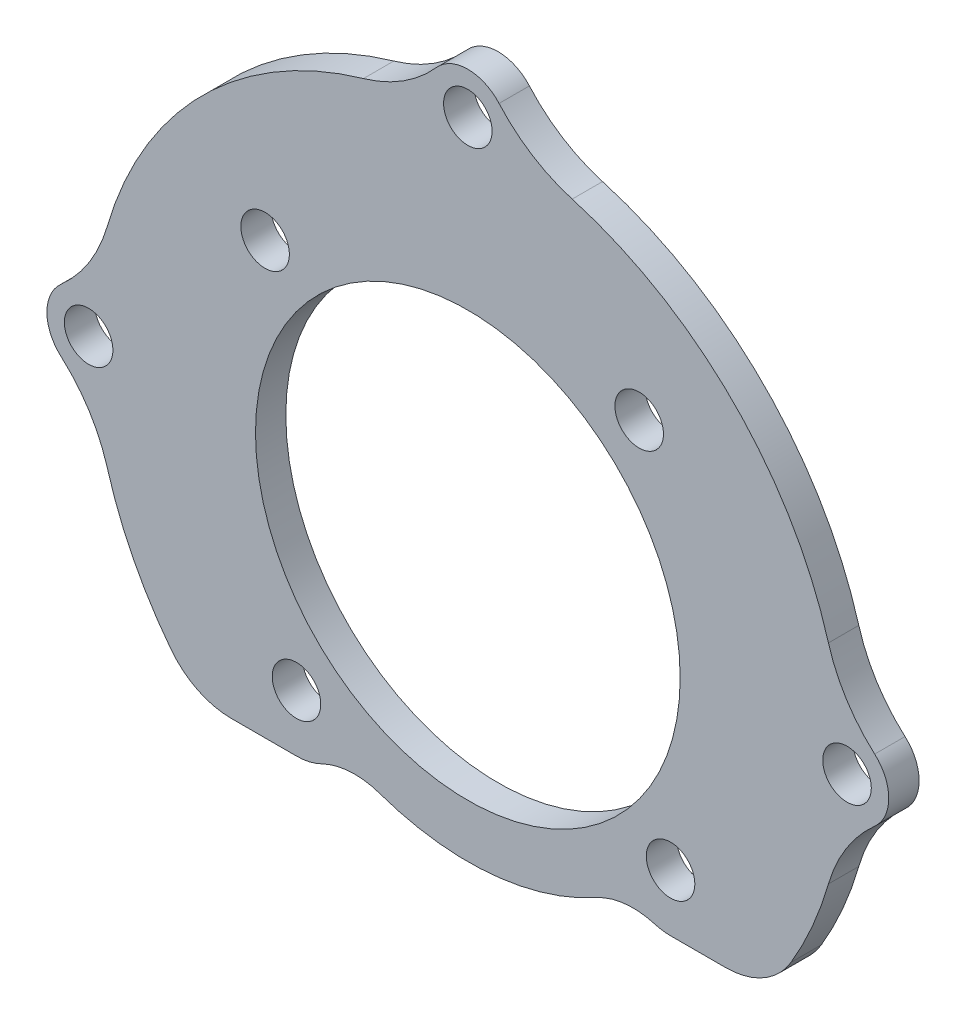
ISO-10303-21;
HEADER;
FILE_DESCRIPTION(('STEP AP214'),'2;1');
FILE_NAME('part.step','',(''),(''),'','','');
FILE_SCHEMA(('AUTOMOTIVE_DESIGN { 1 0 10303 214 1 1 1 1 }'));
ENDSEC;
DATA;
#1=APPLICATION_CONTEXT('core data for automotive mechanical design processes');
#2=APPLICATION_PROTOCOL_DEFINITION('international standard','automotive_design',2000,#1);
#3=PRODUCT_CONTEXT('',#1,'mechanical');
#4=PRODUCT('Part','Part','',(#3));
#5=PRODUCT_RELATED_PRODUCT_CATEGORY('part','',(#4));
#6=PRODUCT_DEFINITION_FORMATION('','',#4);
#7=PRODUCT_DEFINITION_CONTEXT('part definition',#1,'design');
#8=PRODUCT_DEFINITION('design','',#6,#7);
#9=PRODUCT_DEFINITION_SHAPE('','',#8);
#10=(LENGTH_UNIT() NAMED_UNIT(*) SI_UNIT(.MILLI.,.METRE.));
#11=(NAMED_UNIT(*) PLANE_ANGLE_UNIT() SI_UNIT($,.RADIAN.));
#12=(NAMED_UNIT(*) SI_UNIT($,.STERADIAN.) SOLID_ANGLE_UNIT());
#13=UNCERTAINTY_MEASURE_WITH_UNIT(LENGTH_MEASURE(1.E-05),#10,'distance_accuracy_value','');
#14=(GEOMETRIC_REPRESENTATION_CONTEXT(3) GLOBAL_UNCERTAINTY_ASSIGNED_CONTEXT((#13)) GLOBAL_UNIT_ASSIGNED_CONTEXT((#10,
#11,#12)) REPRESENTATION_CONTEXT('',''));
#15=CARTESIAN_POINT('',(0.,0.,0.));
#16=DIRECTION('',(0.,0.,1.));
#17=DIRECTION('',(1.,0.,0.));
#18=AXIS2_PLACEMENT_3D('',#15,#16,#17);
#19=CARTESIAN_POINT('',(0.,0.,2.));
#20=DIRECTION('',(0.,0.,1.));
#21=DIRECTION('',(1.,0.,0.));
#22=AXIS2_PLACEMENT_3D('',#19,#20,#21);
#23=PLANE('',#22);
#24=CARTESIAN_POINT('',(-36.2962532754929,-53.4658019563387,2.));
#25=DIRECTION('',(0.,0.,1.));
#26=DIRECTION('',(1.,0.,0.));
#27=AXIS2_PLACEMENT_3D('',#24,#25,#26);
#28=CIRCLE('',#27,1.6);
#29=CARTESIAN_POINT('',(-34.6962532754929,-53.4658019563387,2.));
#30=VERTEX_POINT('',#29);
#31=EDGE_CURVE('E320',#30,#30,#28,.T.);
#32=ORIENTED_EDGE('',*,*,#31,.F.);
#33=EDGE_LOOP('',(#32));
#34=FACE_BOUND('',#33,.T.);
#35=CARTESIAN_POINT('',(-11.6341980436611,-51.3962532754927,2.));
#36=DIRECTION('',(0.,0.,1.));
#37=DIRECTION('',(1.,0.,0.));
#38=AXIS2_PLACEMENT_3D('',#35,#36,#37);
#39=CIRCLE('',#38,1.6);
#40=CARTESIAN_POINT('',(-10.0341980436611,-51.3962532754927,2.));
#41=VERTEX_POINT('',#40);
#42=EDGE_CURVE('E308',#41,#41,#39,.T.);
#43=ORIENTED_EDGE('',*,*,#42,.F.);
#44=EDGE_LOOP('',(#43));
#45=FACE_BOUND('',#44,.T.);
#46=CARTESIAN_POINT('',(-25.,-40.0999999999998,2.));
#47=DIRECTION('',(0.,0.,1.));
#48=DIRECTION('',(1.,0.,0.));
#49=AXIS2_PLACEMENT_3D('',#46,#47,#48);
#50=CIRCLE('',#49,14.);
#51=CARTESIAN_POINT('',(-11.,-40.0999999999998,2.));
#52=VERTEX_POINT('',#51);
#53=EDGE_CURVE('E290',#52,#52,#50,.T.);
#54=ORIENTED_EDGE('',*,*,#53,.F.);
#55=EDGE_LOOP('',(#54));
#56=FACE_BOUND('',#55,.T.);
#57=CARTESIAN_POINT('',(-13.7037467245071,-26.7341980436609,2.));
#58=DIRECTION('',(0.,0.,1.));
#59=DIRECTION('',(1.,0.,0.));
#60=AXIS2_PLACEMENT_3D('',#57,#58,#59);
#61=CIRCLE('',#60,1.6);
#62=CARTESIAN_POINT('',(-12.1037467245071,-26.7341980436609,2.));
#63=VERTEX_POINT('',#62);
#64=EDGE_CURVE('E314',#63,#63,#61,.T.);
#65=ORIENTED_EDGE('',*,*,#64,.F.);
#66=EDGE_LOOP('',(#65));
#67=FACE_BOUND('',#66,.T.);
#68=CARTESIAN_POINT('',(-38.3658019563389,-28.8037467245069,2.));
#69=DIRECTION('',(0.,0.,1.));
#70=DIRECTION('',(1.,0.,0.));
#71=AXIS2_PLACEMENT_3D('',#68,#69,#70);
#72=CIRCLE('',#71,1.6);
#73=CARTESIAN_POINT('',(-36.7658019563389,-28.8037467245069,2.));
#74=VERTEX_POINT('',#73);
#75=EDGE_CURVE('E321',#74,#74,#72,.T.);
#76=ORIENTED_EDGE('',*,*,#75,.F.);
#77=EDGE_LOOP('',(#76));
#78=FACE_BOUND('',#77,.T.);
#79=CARTESIAN_POINT('',(0.,-40.0999999999998,2.));
#80=DIRECTION('',(0.,0.,1.));
#81=DIRECTION('',(1.,0.,0.));
#82=AXIS2_PLACEMENT_3D('',#79,#80,#81);
#83=CIRCLE('',#82,1.6);
#84=CARTESIAN_POINT('',(1.6,-40.0999999999998,2.));
#85=VERTEX_POINT('',#84);
#86=EDGE_CURVE('E263',#85,#85,#83,.T.);
#87=ORIENTED_EDGE('',*,*,#86,.F.);
#88=EDGE_LOOP('',(#87));
#89=FACE_BOUND('',#88,.T.);
#90=CARTESIAN_POINT('',(-25.,-15.0999999999998,2.));
#91=DIRECTION('',(0.,0.,1.));
#92=DIRECTION('',(1.,0.,0.));
#93=AXIS2_PLACEMENT_3D('',#90,#91,#92);
#94=CIRCLE('',#93,1.6);
#95=CARTESIAN_POINT('',(-23.4,-15.0999999999998,2.));
#96=VERTEX_POINT('',#95);
#97=EDGE_CURVE('E297',#96,#96,#94,.T.);
#98=ORIENTED_EDGE('',*,*,#97,.F.);
#99=EDGE_LOOP('',(#98));
#100=FACE_BOUND('',#99,.T.);
#101=CARTESIAN_POINT('',(-50.,-40.0999999999998,2.));
#102=DIRECTION('',(0.,0.,1.));
#103=DIRECTION('',(1.,0.,0.));
#104=AXIS2_PLACEMENT_3D('',#101,#102,#103);
#105=CIRCLE('',#104,1.6);
#106=CARTESIAN_POINT('',(-48.4,-40.0999999999998,2.));
#107=VERTEX_POINT('',#106);
#108=EDGE_CURVE('E291',#107,#107,#105,.T.);
#109=ORIENTED_EDGE('',*,*,#108,.F.);
#110=EDGE_LOOP('',(#109));
#111=FACE_BOUND('',#110,.T.);
#112=CARTESIAN_POINT('',(-25.,-40.0999999999998,2.));
#113=DIRECTION('',(0.,0.,1.));
#114=DIRECTION('',(1.,0.,0.));
#115=AXIS2_PLACEMENT_3D('',#112,#113,#114);
#116=CIRCLE('',#115,24.75);
#117=CARTESIAN_POINT('',(-48.7741428571428,-46.9813248294322,2.));
#118=VERTEX_POINT('',#117);
#119=CARTESIAN_POINT('',(-44.5457455475951,-55.2830935908548,2.));
#120=VERTEX_POINT('',#119);
#121=EDGE_CURVE('E240',#118,#120,#116,.T.);
#122=ORIENTED_EDGE('',*,*,#121,.T.);
#123=CARTESIAN_POINT('',(-40.5971100834345,-52.2158019563387,2.));
#124=DIRECTION('',(0.,0.,1.));
#125=DIRECTION('',(0.,-1.,0.));
#126=AXIS2_PLACEMENT_3D('',#123,#124,#125);
#127=CIRCLE('',#126,5.);
#128=CARTESIAN_POINT('',(-40.5971100834345,-57.2158019563387,2.));
#129=VERTEX_POINT('',#128);
#130=EDGE_CURVE('E212',#120,#129,#127,.T.);
#131=ORIENTED_EDGE('',*,*,#130,.T.);
#132=DIRECTION('',(-1.,0.,0.));
#133=VECTOR('',#132,1.);
#134=CARTESIAN_POINT('',(0.,-57.2158019563387,2.));
#135=LINE('',#134,#133);
#136=CARTESIAN_POINT('',(-36.2962532754929,-57.2158019563387,2.));
#137=VERTEX_POINT('',#136);
#138=EDGE_CURVE('E193',#137,#129,#135,.T.);
#139=ORIENTED_EDGE('',*,*,#138,.F.);
#140=CARTESIAN_POINT('',(-36.2962532754929,-53.4658019563387,2.));
#141=DIRECTION('',(0.,0.,1.));
#142=DIRECTION('',(1.,0.,0.));
#143=AXIS2_PLACEMENT_3D('',#140,#141,#142);
#144=CIRCLE('',#143,3.75);
#145=CARTESIAN_POINT('',(-34.6507662159953,-56.8355011027056,2.));
#146=VERTEX_POINT('',#145);
#147=EDGE_CURVE('E204',#137,#146,#144,.T.);
#148=ORIENTED_EDGE('',*,*,#147,.T.);
#149=CARTESIAN_POINT('',(-32.4567834699984,-61.3284332978614,2.));
#150=DIRECTION('',(0.,0.,1.));
#151=DIRECTION('',(0.,-1.,0.));
#152=AXIS2_PLACEMENT_3D('',#149,#150,#151);
#153=CIRCLE('',#152,5.);
#154=CARTESIAN_POINT('',(-30.7997204766657,-56.6110036761153,2.));
#155=VERTEX_POINT('',#154);
#156=EDGE_CURVE('E47',#146,#155,#153,.F.);
#157=ORIENTED_EDGE('',*,*,#156,.T.);
#158=CARTESIAN_POINT('',(-25.,-40.0999999999998,2.));
#159=DIRECTION('',(0.,0.,1.));
#160=DIRECTION('',(1.,0.,0.));
#161=AXIS2_PLACEMENT_3D('',#158,#159,#160);
#162=CIRCLE('',#161,17.5000000000045);
#163=CARTESIAN_POINT('',(-16.5296833529576,-55.4135148120536,2.));
#164=VERTEX_POINT('',#163);
#165=EDGE_CURVE('E208',#155,#164,#162,.T.);
#166=ORIENTED_EDGE('',*,*,#165,.T.);
#167=CARTESIAN_POINT('',(-14.1095928823746,-59.7888047583536,2.));
#168=DIRECTION('',(0.,0.,1.));
#169=DIRECTION('',(0.,-1.,0.));
#170=AXIS2_PLACEMENT_3D('',#167,#168,#169);
#171=CIRCLE('',#170,5.);
#172=CARTESIAN_POINT('',(-12.6950815459669,-54.9930610538617,2.));
#173=VERTEX_POINT('',#172);
#174=EDGE_CURVE('E54',#164,#173,#171,.F.);
#175=ORIENTED_EDGE('',*,*,#174,.T.);
#176=CARTESIAN_POINT('',(-11.6341980436611,-51.3962532754927,2.));
#177=DIRECTION('',(0.,0.,1.));
#178=DIRECTION('',(1.,0.,0.));
#179=AXIS2_PLACEMENT_3D('',#176,#177,#178);
#180=CIRCLE('',#179,3.75);
#181=CARTESIAN_POINT('',(-11.6341980436611,-55.1462532754927,2.));
#182=VERTEX_POINT('',#181);
#183=EDGE_CURVE('E505',#173,#182,#180,.T.);
#184=ORIENTED_EDGE('',*,*,#183,.T.);
#185=DIRECTION('',(1.,0.,0.));
#186=VECTOR('',#185,1.);
#187=CARTESIAN_POINT('',(0.,-55.1462532754927,2.));
#188=LINE('',#187,#186);
#189=CARTESIAN_POINT('',(-7.9960211972419,-55.1462532754927,2.));
#190=VERTEX_POINT('',#189);
#191=EDGE_CURVE('E201',#182,#190,#188,.T.);
#192=ORIENTED_EDGE('',*,*,#191,.T.);
#193=CARTESIAN_POINT('',(-7.9960211972419,-50.1462532754927,2.));
#194=DIRECTION('',(0.,0.,1.));
#195=DIRECTION('',(0.,-1.,0.));
#196=AXIS2_PLACEMENT_3D('',#193,#194,#195);
#197=CIRCLE('',#196,5.);
#198=CARTESIAN_POINT('',(-3.69121643704997,-52.6896085351112,2.));
#199=VERTEX_POINT('',#198);
#200=EDGE_CURVE('E376',#190,#199,#197,.T.);
#201=ORIENTED_EDGE('',*,*,#200,.T.);
#202=CARTESIAN_POINT('',(-1.22585714285715,-46.9813248294322,2.));
#203=VERTEX_POINT('',#202);
#204=EDGE_CURVE('E239',#199,#203,#116,.T.);
#205=ORIENTED_EDGE('',*,*,#204,.T.);
#206=CARTESIAN_POINT('',(8.62,-49.8311664254598,2.));
#207=DIRECTION('',(0.,0.,-1.));
#208=DIRECTION('',(1.,0.,0.));
#209=AXIS2_PLACEMENT_3D('',#206,#207,#208);
#210=CIRCLE('',#209,10.25);
#211=CARTESIAN_POINT('',(1.82346153846154,-42.1585159746163,2.));
#212=VERTEX_POINT('',#211);
#213=EDGE_CURVE('E242',#203,#212,#210,.T.);
#214=ORIENTED_EDGE('',*,*,#213,.T.);
#215=CARTESIAN_POINT('',(0.,-40.0999999999998,2.));
#216=DIRECTION('',(0.,0.,1.));
#217=DIRECTION('',(1.,0.,0.));
#218=AXIS2_PLACEMENT_3D('',#215,#216,#217);
#219=CIRCLE('',#218,2.75);
#220=CARTESIAN_POINT('',(1.82346153846153,-38.0414840253832,2.));
#221=VERTEX_POINT('',#220);
#222=EDGE_CURVE('E245',#212,#221,#219,.T.);
#223=ORIENTED_EDGE('',*,*,#222,.T.);
#224=CARTESIAN_POINT('',(8.62,-30.3688335745397,2.));
#225=DIRECTION('',(0.,0.,-1.));
#226=DIRECTION('',(1.,0.,0.));
#227=AXIS2_PLACEMENT_3D('',#224,#225,#226);
#228=CIRCLE('',#227,10.25);
#229=CARTESIAN_POINT('',(-1.22585714285715,-33.2186751705673,2.));
#230=VERTEX_POINT('',#229);
#231=EDGE_CURVE('E248',#221,#230,#228,.T.);
#232=ORIENTED_EDGE('',*,*,#231,.T.);
#233=CARTESIAN_POINT('',(-25.,-40.0999999999998,2.));
#234=DIRECTION('',(0.,0.,1.));
#235=DIRECTION('',(1.,0.,0.));
#236=AXIS2_PLACEMENT_3D('',#233,#234,#235);
#237=CIRCLE('',#236,24.75);
#238=CARTESIAN_POINT('',(-18.1186751705679,-16.3258571428568,2.));
#239=VERTEX_POINT('',#238);
#240=EDGE_CURVE('E251',#230,#239,#237,.T.);
#241=ORIENTED_EDGE('',*,*,#240,.T.);
#242=CARTESIAN_POINT('',(-15.2688335745405,-6.47999999999962,2.));
#243=DIRECTION('',(0.,0.,-1.));
#244=DIRECTION('',(1.,0.,0.));
#245=AXIS2_PLACEMENT_3D('',#242,#243,#244);
#246=CIRCLE('',#245,10.25);
#247=CARTESIAN_POINT('',(-22.9414840253836,-13.2765384615385,2.));
#248=VERTEX_POINT('',#247);
#249=EDGE_CURVE('E254',#239,#248,#246,.T.);
#250=ORIENTED_EDGE('',*,*,#249,.T.);
#251=CARTESIAN_POINT('',(-25.,-15.1000000000002,2.));
#252=DIRECTION('',(0.,0.,1.));
#253=DIRECTION('',(1.,0.,0.));
#254=AXIS2_PLACEMENT_3D('',#251,#252,#253);
#255=CIRCLE('',#254,2.75);
#256=CARTESIAN_POINT('',(-27.0585159746164,-13.2765384615385,2.));
#257=VERTEX_POINT('',#256);
#258=EDGE_CURVE('E257',#248,#257,#255,.T.);
#259=ORIENTED_EDGE('',*,*,#258,.T.);
#260=CARTESIAN_POINT('',(-34.7311664254595,-6.47999999999962,2.));
#261=DIRECTION('',(0.,0.,-1.));
#262=DIRECTION('',(1.,0.,0.));
#263=AXIS2_PLACEMENT_3D('',#260,#261,#262);
#264=CIRCLE('',#263,10.25);
#265=CARTESIAN_POINT('',(-31.8813248294321,-16.3258571428568,2.));
#266=VERTEX_POINT('',#265);
#267=EDGE_CURVE('E224',#257,#266,#264,.T.);
#268=ORIENTED_EDGE('',*,*,#267,.T.);
#269=CARTESIAN_POINT('',(-25.,-40.0999999999998,2.));
#270=DIRECTION('',(0.,0.,1.));
#271=DIRECTION('',(1.,0.,0.));
#272=AXIS2_PLACEMENT_3D('',#269,#270,#271);
#273=CIRCLE('',#272,24.75);
#274=CARTESIAN_POINT('',(-48.7741428571429,-33.2186751705673,2.));
#275=VERTEX_POINT('',#274);
#276=EDGE_CURVE('E227',#266,#275,#273,.T.);
#277=ORIENTED_EDGE('',*,*,#276,.T.);
#278=CARTESIAN_POINT('',(-58.62,-30.3688335745398,2.));
#279=DIRECTION('',(0.,0.,-1.));
#280=DIRECTION('',(1.,0.,0.));
#281=AXIS2_PLACEMENT_3D('',#278,#279,#280);
#282=CIRCLE('',#281,10.25);
#283=CARTESIAN_POINT('',(-51.8234615384616,-38.0414840253832,2.));
#284=VERTEX_POINT('',#283);
#285=EDGE_CURVE('E230',#275,#284,#282,.T.);
#286=ORIENTED_EDGE('',*,*,#285,.T.);
#287=CARTESIAN_POINT('',(-50.,-40.0999999999998,2.));
#288=DIRECTION('',(0.,0.,1.));
#289=DIRECTION('',(1.,0.,0.));
#290=AXIS2_PLACEMENT_3D('',#287,#288,#289);
#291=CIRCLE('',#290,2.75);
#292=CARTESIAN_POINT('',(-51.8234615384615,-42.1585159746163,2.));
#293=VERTEX_POINT('',#292);
#294=EDGE_CURVE('E233',#284,#293,#291,.T.);
#295=ORIENTED_EDGE('',*,*,#294,.T.);
#296=CARTESIAN_POINT('',(-58.62,-49.8311664254598,2.));
#297=DIRECTION('',(0.,0.,-1.));
#298=DIRECTION('',(1.,0.,0.));
#299=AXIS2_PLACEMENT_3D('',#296,#297,#298);
#300=CIRCLE('',#299,10.25);
#301=EDGE_CURVE('E236',#293,#118,#300,.T.);
#302=ORIENTED_EDGE('',*,*,#301,.T.);
#303=EDGE_LOOP('',(#122,#131,#139,#148,#157,#166,#175,#184,#192,#201,#205,#214,#223,#232,#241,
#250,#259,#268,#277,#286,#295,#302));
#304=FACE_BOUND('',#303,.T.);
#305=ADVANCED_FACE('F39',(#34,#45,#56,#67,#78,#89,#100,#111,#304),#23,.T.);
#306=CARTESIAN_POINT('',(0.,0.,0.));
#307=DIRECTION('',(0.,0.,1.));
#308=DIRECTION('',(1.,0.,0.));
#309=AXIS2_PLACEMENT_3D('',#306,#307,#308);
#310=PLANE('',#309);
#311=CARTESIAN_POINT('',(-50.,-40.0999999999998,0.));
#312=DIRECTION('',(0.,0.,1.));
#313=DIRECTION('',(1.,0.,0.));
#314=AXIS2_PLACEMENT_3D('',#311,#312,#313);
#315=CIRCLE('',#314,1.6);
#316=CARTESIAN_POINT('',(-48.4,-40.0999999999998,0.));
#317=VERTEX_POINT('',#316);
#318=EDGE_CURVE('E287',#317,#317,#315,.T.);
#319=ORIENTED_EDGE('',*,*,#318,.T.);
#320=EDGE_LOOP('',(#319));
#321=FACE_BOUND('',#320,.T.);
#322=CARTESIAN_POINT('',(-25.,-15.0999999999998,0.));
#323=DIRECTION('',(0.,0.,1.));
#324=DIRECTION('',(1.,0.,0.));
#325=AXIS2_PLACEMENT_3D('',#322,#323,#324);
#326=CIRCLE('',#325,1.6);
#327=CARTESIAN_POINT('',(-23.4,-15.0999999999998,0.));
#328=VERTEX_POINT('',#327);
#329=EDGE_CURVE('E294',#328,#328,#326,.T.);
#330=ORIENTED_EDGE('',*,*,#329,.T.);
#331=EDGE_LOOP('',(#330));
#332=FACE_BOUND('',#331,.T.);
#333=CARTESIAN_POINT('',(0.,-40.0999999999998,0.));
#334=DIRECTION('',(0.,0.,1.));
#335=DIRECTION('',(1.,0.,0.));
#336=AXIS2_PLACEMENT_3D('',#333,#334,#335);
#337=CIRCLE('',#336,1.6);
#338=CARTESIAN_POINT('',(1.6,-40.0999999999998,0.));
#339=VERTEX_POINT('',#338);
#340=EDGE_CURVE('E300',#339,#339,#337,.T.);
#341=ORIENTED_EDGE('',*,*,#340,.T.);
#342=EDGE_LOOP('',(#341));
#343=FACE_BOUND('',#342,.T.);
#344=CARTESIAN_POINT('',(-38.3658019563389,-28.8037467245069,0.));
#345=DIRECTION('',(0.,0.,1.));
#346=DIRECTION('',(1.,0.,0.));
#347=AXIS2_PLACEMENT_3D('',#344,#345,#346);
#348=CIRCLE('',#347,1.6);
#349=CARTESIAN_POINT('',(-36.7658019563389,-28.8037467245069,0.));
#350=VERTEX_POINT('',#349);
#351=EDGE_CURVE('E317',#350,#350,#348,.T.);
#352=ORIENTED_EDGE('',*,*,#351,.T.);
#353=EDGE_LOOP('',(#352));
#354=FACE_BOUND('',#353,.T.);
#355=CARTESIAN_POINT('',(-13.7037467245071,-26.7341980436609,0.));
#356=DIRECTION('',(0.,0.,1.));
#357=DIRECTION('',(1.,0.,0.));
#358=AXIS2_PLACEMENT_3D('',#355,#356,#357);
#359=CIRCLE('',#358,1.6);
#360=CARTESIAN_POINT('',(-12.1037467245071,-26.7341980436609,0.));
#361=VERTEX_POINT('',#360);
#362=EDGE_CURVE('E324',#361,#361,#359,.T.);
#363=ORIENTED_EDGE('',*,*,#362,.T.);
#364=EDGE_LOOP('',(#363));
#365=FACE_BOUND('',#364,.T.);
#366=CARTESIAN_POINT('',(-25.,-40.0999999999998,0.));
#367=DIRECTION('',(0.,0.,1.));
#368=DIRECTION('',(1.,0.,0.));
#369=AXIS2_PLACEMENT_3D('',#366,#367,#368);
#370=CIRCLE('',#369,14.);
#371=CARTESIAN_POINT('',(-11.,-40.0999999999998,0.));
#372=VERTEX_POINT('',#371);
#373=EDGE_CURVE('E305',#372,#372,#370,.T.);
#374=ORIENTED_EDGE('',*,*,#373,.T.);
#375=EDGE_LOOP('',(#374));
#376=FACE_BOUND('',#375,.T.);
#377=CARTESIAN_POINT('',(-11.6341980436611,-51.3962532754927,0.));
#378=DIRECTION('',(0.,0.,1.));
#379=DIRECTION('',(1.,0.,0.));
#380=AXIS2_PLACEMENT_3D('',#377,#378,#379);
#381=CIRCLE('',#380,1.6);
#382=CARTESIAN_POINT('',(-10.0341980436611,-51.3962532754927,0.));
#383=VERTEX_POINT('',#382);
#384=EDGE_CURVE('E311',#383,#383,#381,.T.);
#385=ORIENTED_EDGE('',*,*,#384,.T.);
#386=EDGE_LOOP('',(#385));
#387=FACE_BOUND('',#386,.T.);
#388=CARTESIAN_POINT('',(-36.2962532754929,-53.4658019563387,0.));
#389=DIRECTION('',(0.,0.,1.));
#390=DIRECTION('',(1.,0.,0.));
#391=AXIS2_PLACEMENT_3D('',#388,#389,#390);
#392=CIRCLE('',#391,1.6);
#393=CARTESIAN_POINT('',(-34.6962532754929,-53.4658019563387,0.));
#394=VERTEX_POINT('',#393);
#395=EDGE_CURVE('E329',#394,#394,#392,.T.);
#396=ORIENTED_EDGE('',*,*,#395,.T.);
#397=EDGE_LOOP('',(#396));
#398=FACE_BOUND('',#397,.T.);
#399=DIRECTION('',(-1.,0.,0.));
#400=VECTOR('',#399,1.);
#401=CARTESIAN_POINT('',(0.,-57.2158019563387,0.));
#402=LINE('',#401,#400);
#403=CARTESIAN_POINT('',(-36.2962532754929,-57.2158019563387,0.));
#404=VERTEX_POINT('',#403);
#405=CARTESIAN_POINT('',(-40.5971100834345,-57.2158019563387,0.));
#406=VERTEX_POINT('',#405);
#407=EDGE_CURVE('E196',#404,#406,#402,.T.);
#408=ORIENTED_EDGE('',*,*,#407,.T.);
#409=CARTESIAN_POINT('',(-40.5971100834345,-52.2158019563387,0.));
#410=DIRECTION('',(0.,0.,1.));
#411=DIRECTION('',(0.,-1.,0.));
#412=AXIS2_PLACEMENT_3D('',#409,#410,#411);
#413=CIRCLE('',#412,5.);
#414=CARTESIAN_POINT('',(-44.5457455475951,-55.2830935908548,0.));
#415=VERTEX_POINT('',#414);
#416=EDGE_CURVE('E372',#406,#415,#413,.F.);
#417=ORIENTED_EDGE('',*,*,#416,.T.);
#418=CARTESIAN_POINT('',(-25.,-40.0999999999998,0.));
#419=DIRECTION('',(0.,0.,1.));
#420=DIRECTION('',(0.,-1.,0.));
#421=AXIS2_PLACEMENT_3D('',#418,#419,#420);
#422=CIRCLE('',#421,24.75);
#423=CARTESIAN_POINT('',(-48.7741428571428,-46.9813248294322,0.));
#424=VERTEX_POINT('',#423);
#425=EDGE_CURVE('E343',#424,#415,#422,.T.);
#426=ORIENTED_EDGE('',*,*,#425,.F.);
#427=CARTESIAN_POINT('',(-58.62,-49.8311664254598,0.));
#428=DIRECTION('',(0.,0.,1.));
#429=DIRECTION('',(0.,-1.,0.));
#430=AXIS2_PLACEMENT_3D('',#427,#428,#429);
#431=CIRCLE('',#430,10.25);
#432=CARTESIAN_POINT('',(-51.8234615384615,-42.1585159746163,0.));
#433=VERTEX_POINT('',#432);
#434=EDGE_CURVE('E340',#433,#424,#431,.F.);
#435=ORIENTED_EDGE('',*,*,#434,.F.);
#436=CARTESIAN_POINT('',(-50.,-40.0999999999998,0.));
#437=DIRECTION('',(0.,0.,1.));
#438=DIRECTION('',(0.,-1.,0.));
#439=AXIS2_PLACEMENT_3D('',#436,#437,#438);
#440=CIRCLE('',#439,2.75);
#441=CARTESIAN_POINT('',(-51.8234615384616,-38.0414840253832,0.));
#442=VERTEX_POINT('',#441);
#443=EDGE_CURVE('E338',#442,#433,#440,.T.);
#444=ORIENTED_EDGE('',*,*,#443,.F.);
#445=CARTESIAN_POINT('',(-58.62,-30.3688335745398,0.));
#446=DIRECTION('',(0.,0.,1.));
#447=DIRECTION('',(0.,-1.,0.));
#448=AXIS2_PLACEMENT_3D('',#445,#446,#447);
#449=CIRCLE('',#448,10.25);
#450=CARTESIAN_POINT('',(-48.7741428571429,-33.2186751705673,0.));
#451=VERTEX_POINT('',#450);
#452=EDGE_CURVE('E336',#451,#442,#449,.F.);
#453=ORIENTED_EDGE('',*,*,#452,.F.);
#454=CARTESIAN_POINT('',(-25.,-40.0999999999998,0.));
#455=DIRECTION('',(0.,0.,1.));
#456=DIRECTION('',(0.,-1.,0.));
#457=AXIS2_PLACEMENT_3D('',#454,#455,#456);
#458=CIRCLE('',#457,24.75);
#459=CARTESIAN_POINT('',(-31.8813248294321,-16.3258571428568,0.));
#460=VERTEX_POINT('',#459);
#461=EDGE_CURVE('E332',#460,#451,#458,.T.);
#462=ORIENTED_EDGE('',*,*,#461,.F.);
#463=CARTESIAN_POINT('',(-34.7311664254595,-6.47999999999962,0.));
#464=DIRECTION('',(0.,0.,1.));
#465=DIRECTION('',(0.,-1.,0.));
#466=AXIS2_PLACEMENT_3D('',#463,#464,#465);
#467=CIRCLE('',#466,10.25);
#468=CARTESIAN_POINT('',(-27.0585159746164,-13.2765384615385,0.));
#469=VERTEX_POINT('',#468);
#470=EDGE_CURVE('E358',#469,#460,#467,.F.);
#471=ORIENTED_EDGE('',*,*,#470,.F.);
#472=CARTESIAN_POINT('',(-25.,-15.1000000000002,0.));
#473=DIRECTION('',(0.,0.,1.));
#474=DIRECTION('',(0.,-1.,0.));
#475=AXIS2_PLACEMENT_3D('',#472,#473,#474);
#476=CIRCLE('',#475,2.75);
#477=CARTESIAN_POINT('',(-22.9414840253836,-13.2765384615385,0.));
#478=VERTEX_POINT('',#477);
#479=EDGE_CURVE('E356',#478,#469,#476,.T.);
#480=ORIENTED_EDGE('',*,*,#479,.F.);
#481=CARTESIAN_POINT('',(-15.2688335745405,-6.47999999999962,0.));
#482=DIRECTION('',(0.,0.,1.));
#483=DIRECTION('',(0.,-1.,0.));
#484=AXIS2_PLACEMENT_3D('',#481,#482,#483);
#485=CIRCLE('',#484,10.25);
#486=CARTESIAN_POINT('',(-18.1186751705679,-16.3258571428568,0.));
#487=VERTEX_POINT('',#486);
#488=EDGE_CURVE('E354',#487,#478,#485,.F.);
#489=ORIENTED_EDGE('',*,*,#488,.F.);
#490=CARTESIAN_POINT('',(-25.,-40.0999999999998,0.));
#491=DIRECTION('',(0.,0.,1.));
#492=DIRECTION('',(0.,-1.,0.));
#493=AXIS2_PLACEMENT_3D('',#490,#491,#492);
#494=CIRCLE('',#493,24.75);
#495=CARTESIAN_POINT('',(-1.22585714285715,-33.2186751705673,0.));
#496=VERTEX_POINT('',#495);
#497=EDGE_CURVE('E352',#496,#487,#494,.T.);
#498=ORIENTED_EDGE('',*,*,#497,.F.);
#499=CARTESIAN_POINT('',(8.62,-30.3688335745397,0.));
#500=DIRECTION('',(0.,0.,1.));
#501=DIRECTION('',(0.,-1.,0.));
#502=AXIS2_PLACEMENT_3D('',#499,#500,#501);
#503=CIRCLE('',#502,10.25);
#504=CARTESIAN_POINT('',(1.82346153846153,-38.0414840253832,0.));
#505=VERTEX_POINT('',#504);
#506=EDGE_CURVE('E350',#505,#496,#503,.F.);
#507=ORIENTED_EDGE('',*,*,#506,.F.);
#508=CARTESIAN_POINT('',(0.,-40.0999999999998,0.));
#509=DIRECTION('',(0.,0.,1.));
#510=DIRECTION('',(0.,-1.,0.));
#511=AXIS2_PLACEMENT_3D('',#508,#509,#510);
#512=CIRCLE('',#511,2.75);
#513=CARTESIAN_POINT('',(1.82346153846154,-42.1585159746163,0.));
#514=VERTEX_POINT('',#513);
#515=EDGE_CURVE('E348',#514,#505,#512,.T.);
#516=ORIENTED_EDGE('',*,*,#515,.F.);
#517=CARTESIAN_POINT('',(8.62,-49.8311664254598,0.));
#518=DIRECTION('',(0.,0.,1.));
#519=DIRECTION('',(0.,-1.,0.));
#520=AXIS2_PLACEMENT_3D('',#517,#518,#519);
#521=CIRCLE('',#520,10.25);
#522=CARTESIAN_POINT('',(-1.22585714285715,-46.9813248294322,0.));
#523=VERTEX_POINT('',#522);
#524=EDGE_CURVE('E346',#523,#514,#521,.F.);
#525=ORIENTED_EDGE('',*,*,#524,.F.);
#526=CARTESIAN_POINT('',(-3.69121643704997,-52.6896085351112,0.));
#527=VERTEX_POINT('',#526);
#528=EDGE_CURVE('E342',#527,#523,#422,.T.);
#529=ORIENTED_EDGE('',*,*,#528,.F.);
#530=CARTESIAN_POINT('',(-7.9960211972419,-50.1462532754927,0.));
#531=DIRECTION('',(0.,0.,1.));
#532=DIRECTION('',(0.,-1.,0.));
#533=AXIS2_PLACEMENT_3D('',#530,#531,#532);
#534=CIRCLE('',#533,5.);
#535=CARTESIAN_POINT('',(-7.9960211972419,-55.1462532754927,0.));
#536=VERTEX_POINT('',#535);
#537=EDGE_CURVE('E370',#527,#536,#534,.F.);
#538=ORIENTED_EDGE('',*,*,#537,.T.);
#539=DIRECTION('',(1.,0.,0.));
#540=VECTOR('',#539,1.);
#541=CARTESIAN_POINT('',(0.,-55.1462532754927,0.));
#542=LINE('',#541,#540);
#543=CARTESIAN_POINT('',(-11.6341980436611,-55.1462532754927,0.));
#544=VERTEX_POINT('',#543);
#545=EDGE_CURVE('E221',#544,#536,#542,.T.);
#546=ORIENTED_EDGE('',*,*,#545,.F.);
#547=CARTESIAN_POINT('',(-11.6341980436611,-51.3962532754927,0.));
#548=DIRECTION('',(0.,0.,1.));
#549=DIRECTION('',(0.,-1.,0.));
#550=AXIS2_PLACEMENT_3D('',#547,#548,#549);
#551=CIRCLE('',#550,3.75);
#552=CARTESIAN_POINT('',(-12.6950815459669,-54.9930610538617,0.));
#553=VERTEX_POINT('',#552);
#554=EDGE_CURVE('E366',#553,#544,#551,.T.);
#555=ORIENTED_EDGE('',*,*,#554,.F.);
#556=CARTESIAN_POINT('',(-14.1095928823746,-59.7888047583536,0.));
#557=DIRECTION('',(0.,0.,1.));
#558=DIRECTION('',(0.,-1.,0.));
#559=AXIS2_PLACEMENT_3D('',#556,#557,#558);
#560=CIRCLE('',#559,5.);
#561=CARTESIAN_POINT('',(-16.5296833529576,-55.4135148120536,0.));
#562=VERTEX_POINT('',#561);
#563=EDGE_CURVE('E392',#553,#562,#560,.T.);
#564=ORIENTED_EDGE('',*,*,#563,.T.);
#565=CARTESIAN_POINT('',(-25.,-40.0999999999998,0.));
#566=DIRECTION('',(0.,0.,1.));
#567=DIRECTION('',(0.,-1.,0.));
#568=AXIS2_PLACEMENT_3D('',#565,#566,#567);
#569=CIRCLE('',#568,17.5000000000045);
#570=CARTESIAN_POINT('',(-30.7997204766657,-56.6110036761153,0.));
#571=VERTEX_POINT('',#570);
#572=EDGE_CURVE('E361',#571,#562,#569,.T.);
#573=ORIENTED_EDGE('',*,*,#572,.F.);
#574=CARTESIAN_POINT('',(-32.4567834699984,-61.3284332978614,0.));
#575=DIRECTION('',(0.,0.,1.));
#576=DIRECTION('',(0.,-1.,0.));
#577=AXIS2_PLACEMENT_3D('',#574,#575,#576);
#578=CIRCLE('',#577,5.);
#579=CARTESIAN_POINT('',(-34.6507662159953,-56.8355011027056,0.));
#580=VERTEX_POINT('',#579);
#581=EDGE_CURVE('E12',#571,#580,#578,.T.);
#582=ORIENTED_EDGE('',*,*,#581,.T.);
#583=CARTESIAN_POINT('',(-36.2962532754929,-53.4658019563387,0.));
#584=DIRECTION('',(0.,0.,1.));
#585=DIRECTION('',(0.,-1.,0.));
#586=AXIS2_PLACEMENT_3D('',#583,#584,#585);
#587=CIRCLE('',#586,3.75);
#588=EDGE_CURVE('E364',#404,#580,#587,.T.);
#589=ORIENTED_EDGE('',*,*,#588,.F.);
#590=EDGE_LOOP('',(#408,#417,#426,#435,#444,#453,#462,#471,#480,#489,#498,#507,#516,#525,#529,
#538,#546,#555,#564,#573,#582,#589));
#591=FACE_BOUND('',#590,.T.);
#592=ADVANCED_FACE('F397',(#321,#332,#343,#354,#365,#376,#387,#398,#591),#310,.F.);
#593=CARTESIAN_POINT('',(-25.,-40.0999999999998,-8.));
#594=DIRECTION('',(0.,0.,1.));
#595=DIRECTION('',(1.,0.,0.));
#596=AXIS2_PLACEMENT_3D('',#593,#594,#595);
#597=CYLINDRICAL_SURFACE('',#596,24.75);
#598=ORIENTED_EDGE('',*,*,#204,.F.);
#599=DIRECTION('',(0.,0.,1.));
#600=VECTOR('',#599,1.);
#601=CARTESIAN_POINT('',(-3.69121643704996,-52.6896085351112,-8.));
#602=LINE('',#601,#600);
#603=EDGE_CURVE('E379',#199,#527,#602,.F.);
#604=ORIENTED_EDGE('',*,*,#603,.T.);
#605=ORIENTED_EDGE('',*,*,#528,.T.);
#606=DIRECTION('',(0.,0.,1.));
#607=VECTOR('',#606,1.);
#608=CARTESIAN_POINT('',(-1.22585714285715,-46.9813248294322,-8.));
#609=LINE('',#608,#607);
#610=EDGE_CURVE('E274',#523,#203,#609,.T.);
#611=ORIENTED_EDGE('',*,*,#610,.T.);
#612=EDGE_LOOP('',(#598,#604,#605,#611));
#613=FACE_BOUND('',#612,.T.);
#614=ADVANCED_FACE('F420',(#613),#597,.T.);
#615=CARTESIAN_POINT('',(-36.2962532754929,-53.4658019563387,0.));
#616=DIRECTION('',(0.,0.,1.));
#617=DIRECTION('',(1.,0.,0.));
#618=AXIS2_PLACEMENT_3D('',#615,#616,#617);
#619=CYLINDRICAL_SURFACE('',#618,1.6);
#620=ORIENTED_EDGE('',*,*,#395,.F.);
#621=EDGE_LOOP('',(#620));
#622=FACE_BOUND('',#621,.T.);
#623=ORIENTED_EDGE('',*,*,#31,.T.);
#624=EDGE_LOOP('',(#623));
#625=FACE_BOUND('',#624,.T.);
#626=ADVANCED_FACE('F426',(#622,#625),#619,.F.);
#627=CARTESIAN_POINT('',(-11.6341980436611,-51.3962532754927,0.));
#628=DIRECTION('',(0.,0.,1.));
#629=DIRECTION('',(1.,0.,0.));
#630=AXIS2_PLACEMENT_3D('',#627,#628,#629);
#631=CYLINDRICAL_SURFACE('',#630,1.6);
#632=ORIENTED_EDGE('',*,*,#384,.F.);
#633=EDGE_LOOP('',(#632));
#634=FACE_BOUND('',#633,.T.);
#635=ORIENTED_EDGE('',*,*,#42,.T.);
#636=EDGE_LOOP('',(#635));
#637=FACE_BOUND('',#636,.T.);
#638=ADVANCED_FACE('F558',(#634,#637),#631,.F.);
#639=CARTESIAN_POINT('',(-25.,-40.0999999999998,0.));
#640=DIRECTION('',(0.,0.,1.));
#641=DIRECTION('',(1.,0.,0.));
#642=AXIS2_PLACEMENT_3D('',#639,#640,#641);
#643=CYLINDRICAL_SURFACE('',#642,14.);
#644=ORIENTED_EDGE('',*,*,#373,.F.);
#645=EDGE_LOOP('',(#644));
#646=FACE_BOUND('',#645,.T.);
#647=ORIENTED_EDGE('',*,*,#53,.T.);
#648=EDGE_LOOP('',(#647));
#649=FACE_BOUND('',#648,.T.);
#650=ADVANCED_FACE('F554',(#646,#649),#643,.F.);
#651=CARTESIAN_POINT('',(-13.7037467245071,-26.7341980436609,0.));
#652=DIRECTION('',(0.,0.,1.));
#653=DIRECTION('',(1.,0.,0.));
#654=AXIS2_PLACEMENT_3D('',#651,#652,#653);
#655=CYLINDRICAL_SURFACE('',#654,1.6);
#656=ORIENTED_EDGE('',*,*,#362,.F.);
#657=EDGE_LOOP('',(#656));
#658=FACE_BOUND('',#657,.T.);
#659=ORIENTED_EDGE('',*,*,#64,.T.);
#660=EDGE_LOOP('',(#659));
#661=FACE_BOUND('',#660,.T.);
#662=ADVANCED_FACE('F557',(#658,#661),#655,.F.);
#663=CARTESIAN_POINT('',(-38.3658019563389,-28.8037467245069,0.));
#664=DIRECTION('',(0.,0.,1.));
#665=DIRECTION('',(1.,0.,0.));
#666=AXIS2_PLACEMENT_3D('',#663,#664,#665);
#667=CYLINDRICAL_SURFACE('',#666,1.6);
#668=ORIENTED_EDGE('',*,*,#351,.F.);
#669=EDGE_LOOP('',(#668));
#670=FACE_BOUND('',#669,.T.);
#671=ORIENTED_EDGE('',*,*,#75,.T.);
#672=EDGE_LOOP('',(#671));
#673=FACE_BOUND('',#672,.T.);
#674=ADVANCED_FACE('F552',(#670,#673),#667,.F.);
#675=CARTESIAN_POINT('',(0.,-40.0999999999998,0.));
#676=DIRECTION('',(0.,0.,1.));
#677=DIRECTION('',(1.,0.,0.));
#678=AXIS2_PLACEMENT_3D('',#675,#676,#677);
#679=CYLINDRICAL_SURFACE('',#678,1.6);
#680=ORIENTED_EDGE('',*,*,#340,.F.);
#681=EDGE_LOOP('',(#680));
#682=FACE_BOUND('',#681,.T.);
#683=ORIENTED_EDGE('',*,*,#86,.T.);
#684=EDGE_LOOP('',(#683));
#685=FACE_BOUND('',#684,.T.);
#686=ADVANCED_FACE('F548',(#682,#685),#679,.F.);
#687=CARTESIAN_POINT('',(-25.,-15.0999999999998,0.));
#688=DIRECTION('',(0.,0.,1.));
#689=DIRECTION('',(1.,0.,0.));
#690=AXIS2_PLACEMENT_3D('',#687,#688,#689);
#691=CYLINDRICAL_SURFACE('',#690,1.6);
#692=ORIENTED_EDGE('',*,*,#329,.F.);
#693=EDGE_LOOP('',(#692));
#694=FACE_BOUND('',#693,.T.);
#695=ORIENTED_EDGE('',*,*,#97,.T.);
#696=EDGE_LOOP('',(#695));
#697=FACE_BOUND('',#696,.T.);
#698=ADVANCED_FACE('F544',(#694,#697),#691,.F.);
#699=CARTESIAN_POINT('',(-50.,-40.0999999999998,0.));
#700=DIRECTION('',(0.,0.,1.));
#701=DIRECTION('',(1.,0.,0.));
#702=AXIS2_PLACEMENT_3D('',#699,#700,#701);
#703=CYLINDRICAL_SURFACE('',#702,1.6);
#704=ORIENTED_EDGE('',*,*,#318,.F.);
#705=EDGE_LOOP('',(#704));
#706=FACE_BOUND('',#705,.T.);
#707=ORIENTED_EDGE('',*,*,#108,.T.);
#708=EDGE_LOOP('',(#707));
#709=FACE_BOUND('',#708,.T.);
#710=ADVANCED_FACE('F541',(#706,#709),#703,.F.);
#711=CARTESIAN_POINT('',(-34.7311664254595,-6.47999999999962,-8.));
#712=DIRECTION('',(0.,0.,1.));
#713=DIRECTION('',(1.,0.,0.));
#714=AXIS2_PLACEMENT_3D('',#711,#712,#713);
#715=CYLINDRICAL_SURFACE('',#714,10.25);
#716=ORIENTED_EDGE('',*,*,#470,.T.);
#717=DIRECTION('',(0.,0.,1.));
#718=VECTOR('',#717,1.);
#719=CARTESIAN_POINT('',(-31.8813248294321,-16.3258571428568,-8.));
#720=LINE('',#719,#718);
#721=EDGE_CURVE('E260',#460,#266,#720,.T.);
#722=ORIENTED_EDGE('',*,*,#721,.T.);
#723=ORIENTED_EDGE('',*,*,#267,.F.);
#724=DIRECTION('',(0.,0.,1.));
#725=VECTOR('',#724,1.);
#726=CARTESIAN_POINT('',(-27.0585159746164,-13.2765384615385,-8.));
#727=LINE('',#726,#725);
#728=EDGE_CURVE('E261',#469,#257,#727,.T.);
#729=ORIENTED_EDGE('',*,*,#728,.F.);
#730=EDGE_LOOP('',(#716,#722,#723,#729));
#731=FACE_BOUND('',#730,.T.);
#732=ADVANCED_FACE('F464',(#731),#715,.F.);
#733=CARTESIAN_POINT('',(-25.,-15.1000000000002,-8.));
#734=DIRECTION('',(0.,0.,1.));
#735=DIRECTION('',(1.,0.,0.));
#736=AXIS2_PLACEMENT_3D('',#733,#734,#735);
#737=CYLINDRICAL_SURFACE('',#736,2.75);
#738=ORIENTED_EDGE('',*,*,#479,.T.);
#739=ORIENTED_EDGE('',*,*,#728,.T.);
#740=ORIENTED_EDGE('',*,*,#258,.F.);
#741=DIRECTION('',(0.,0.,1.));
#742=VECTOR('',#741,1.);
#743=CARTESIAN_POINT('',(-22.9414840253836,-13.2765384615385,-8.));
#744=LINE('',#743,#742);
#745=EDGE_CURVE('E264',#478,#248,#744,.T.);
#746=ORIENTED_EDGE('',*,*,#745,.F.);
#747=EDGE_LOOP('',(#738,#739,#740,#746));
#748=FACE_BOUND('',#747,.T.);
#749=ADVANCED_FACE('F471',(#748),#737,.T.);
#750=CARTESIAN_POINT('',(-15.2688335745405,-6.47999999999962,-8.));
#751=DIRECTION('',(0.,0.,1.));
#752=DIRECTION('',(1.,0.,0.));
#753=AXIS2_PLACEMENT_3D('',#750,#751,#752);
#754=CYLINDRICAL_SURFACE('',#753,10.25);
#755=ORIENTED_EDGE('',*,*,#488,.T.);
#756=ORIENTED_EDGE('',*,*,#745,.T.);
#757=ORIENTED_EDGE('',*,*,#249,.F.);
#758=DIRECTION('',(0.,0.,1.));
#759=VECTOR('',#758,1.);
#760=CARTESIAN_POINT('',(-18.1186751705679,-16.3258571428568,-8.));
#761=LINE('',#760,#759);
#762=EDGE_CURVE('E266',#487,#239,#761,.T.);
#763=ORIENTED_EDGE('',*,*,#762,.F.);
#764=EDGE_LOOP('',(#755,#756,#757,#763));
#765=FACE_BOUND('',#764,.T.);
#766=ADVANCED_FACE('F474',(#765),#754,.F.);
#767=CARTESIAN_POINT('',(-25.,-40.0999999999998,-8.));
#768=DIRECTION('',(0.,0.,1.));
#769=DIRECTION('',(1.,0.,0.));
#770=AXIS2_PLACEMENT_3D('',#767,#768,#769);
#771=CYLINDRICAL_SURFACE('',#770,24.75);
#772=ORIENTED_EDGE('',*,*,#497,.T.);
#773=ORIENTED_EDGE('',*,*,#762,.T.);
#774=ORIENTED_EDGE('',*,*,#240,.F.);
#775=DIRECTION('',(0.,0.,1.));
#776=VECTOR('',#775,1.);
#777=CARTESIAN_POINT('',(-1.22585714285715,-33.2186751705673,-8.));
#778=LINE('',#777,#776);
#779=EDGE_CURVE('E268',#496,#230,#778,.T.);
#780=ORIENTED_EDGE('',*,*,#779,.F.);
#781=EDGE_LOOP('',(#772,#773,#774,#780));
#782=FACE_BOUND('',#781,.T.);
#783=ADVANCED_FACE('F478',(#782),#771,.T.);
#784=CARTESIAN_POINT('',(8.62,-30.3688335745397,-8.));
#785=DIRECTION('',(0.,0.,1.));
#786=DIRECTION('',(1.,0.,0.));
#787=AXIS2_PLACEMENT_3D('',#784,#785,#786);
#788=CYLINDRICAL_SURFACE('',#787,10.25);
#789=ORIENTED_EDGE('',*,*,#506,.T.);
#790=ORIENTED_EDGE('',*,*,#779,.T.);
#791=ORIENTED_EDGE('',*,*,#231,.F.);
#792=DIRECTION('',(0.,0.,1.));
#793=VECTOR('',#792,1.);
#794=CARTESIAN_POINT('',(1.82346153846153,-38.0414840253832,-8.));
#795=LINE('',#794,#793);
#796=EDGE_CURVE('E270',#505,#221,#795,.T.);
#797=ORIENTED_EDGE('',*,*,#796,.F.);
#798=EDGE_LOOP('',(#789,#790,#791,#797));
#799=FACE_BOUND('',#798,.T.);
#800=ADVANCED_FACE('F485',(#799),#788,.F.);
#801=CARTESIAN_POINT('',(0.,-40.0999999999998,-8.));
#802=DIRECTION('',(0.,0.,1.));
#803=DIRECTION('',(1.,0.,0.));
#804=AXIS2_PLACEMENT_3D('',#801,#802,#803);
#805=CYLINDRICAL_SURFACE('',#804,2.75);
#806=ORIENTED_EDGE('',*,*,#515,.T.);
#807=ORIENTED_EDGE('',*,*,#796,.T.);
#808=ORIENTED_EDGE('',*,*,#222,.F.);
#809=DIRECTION('',(0.,0.,1.));
#810=VECTOR('',#809,1.);
#811=CARTESIAN_POINT('',(1.82346153846154,-42.1585159746163,-8.));
#812=LINE('',#811,#810);
#813=EDGE_CURVE('E272',#514,#212,#812,.T.);
#814=ORIENTED_EDGE('',*,*,#813,.F.);
#815=EDGE_LOOP('',(#806,#807,#808,#814));
#816=FACE_BOUND('',#815,.T.);
#817=ADVANCED_FACE('F489',(#816),#805,.T.);
#818=CARTESIAN_POINT('',(8.62,-49.8311664254598,-8.));
#819=DIRECTION('',(0.,0.,1.));
#820=DIRECTION('',(1.,0.,0.));
#821=AXIS2_PLACEMENT_3D('',#818,#819,#820);
#822=CYLINDRICAL_SURFACE('',#821,10.25);
#823=ORIENTED_EDGE('',*,*,#524,.T.);
#824=ORIENTED_EDGE('',*,*,#813,.T.);
#825=ORIENTED_EDGE('',*,*,#213,.F.);
#826=ORIENTED_EDGE('',*,*,#610,.F.);
#827=EDGE_LOOP('',(#823,#824,#825,#826));
#828=FACE_BOUND('',#827,.T.);
#829=ADVANCED_FACE('F493',(#828),#822,.F.);
#830=ORIENTED_EDGE('',*,*,#425,.T.);
#831=DIRECTION('',(0.,0.,1.));
#832=VECTOR('',#831,1.);
#833=CARTESIAN_POINT('',(-44.5457455475951,-55.2830935908548,-8.));
#834=LINE('',#833,#832);
#835=EDGE_CURVE('E374',#415,#120,#834,.T.);
#836=ORIENTED_EDGE('',*,*,#835,.T.);
#837=ORIENTED_EDGE('',*,*,#121,.F.);
#838=DIRECTION('',(0.,0.,1.));
#839=VECTOR('',#838,1.);
#840=CARTESIAN_POINT('',(-48.7741428571428,-46.9813248294322,-8.));
#841=LINE('',#840,#839);
#842=EDGE_CURVE('E277',#424,#118,#841,.T.);
#843=ORIENTED_EDGE('',*,*,#842,.F.);
#844=EDGE_LOOP('',(#830,#836,#837,#843));
#845=FACE_BOUND('',#844,.T.);
#846=ADVANCED_FACE('F441',(#845),#597,.T.);
#847=CARTESIAN_POINT('',(-58.62,-49.8311664254598,-8.));
#848=DIRECTION('',(0.,0.,1.));
#849=DIRECTION('',(1.,0.,0.));
#850=AXIS2_PLACEMENT_3D('',#847,#848,#849);
#851=CYLINDRICAL_SURFACE('',#850,10.25);
#852=ORIENTED_EDGE('',*,*,#434,.T.);
#853=ORIENTED_EDGE('',*,*,#842,.T.);
#854=ORIENTED_EDGE('',*,*,#301,.F.);
#855=DIRECTION('',(0.,0.,1.));
#856=VECTOR('',#855,1.);
#857=CARTESIAN_POINT('',(-51.8234615384615,-42.1585159746163,-8.));
#858=LINE('',#857,#856);
#859=EDGE_CURVE('E279',#433,#293,#858,.T.);
#860=ORIENTED_EDGE('',*,*,#859,.F.);
#861=EDGE_LOOP('',(#852,#853,#854,#860));
#862=FACE_BOUND('',#861,.T.);
#863=ADVANCED_FACE('F445',(#862),#851,.F.);
#864=CARTESIAN_POINT('',(-50.,-40.0999999999998,-8.));
#865=DIRECTION('',(0.,0.,1.));
#866=DIRECTION('',(1.,0.,0.));
#867=AXIS2_PLACEMENT_3D('',#864,#865,#866);
#868=CYLINDRICAL_SURFACE('',#867,2.75);
#869=ORIENTED_EDGE('',*,*,#443,.T.);
#870=ORIENTED_EDGE('',*,*,#859,.T.);
#871=ORIENTED_EDGE('',*,*,#294,.F.);
#872=DIRECTION('',(0.,0.,1.));
#873=VECTOR('',#872,1.);
#874=CARTESIAN_POINT('',(-51.8234615384616,-38.0414840253832,-8.));
#875=LINE('',#874,#873);
#876=EDGE_CURVE('E281',#442,#284,#875,.T.);
#877=ORIENTED_EDGE('',*,*,#876,.F.);
#878=EDGE_LOOP('',(#869,#870,#871,#877));
#879=FACE_BOUND('',#878,.T.);
#880=ADVANCED_FACE('F452',(#879),#868,.T.);
#881=CARTESIAN_POINT('',(-58.62,-30.3688335745398,-8.));
#882=DIRECTION('',(0.,0.,1.));
#883=DIRECTION('',(1.,0.,0.));
#884=AXIS2_PLACEMENT_3D('',#881,#882,#883);
#885=CYLINDRICAL_SURFACE('',#884,10.25);
#886=ORIENTED_EDGE('',*,*,#452,.T.);
#887=ORIENTED_EDGE('',*,*,#876,.T.);
#888=ORIENTED_EDGE('',*,*,#285,.F.);
#889=DIRECTION('',(0.,0.,1.));
#890=VECTOR('',#889,1.);
#891=CARTESIAN_POINT('',(-48.7741428571429,-33.2186751705673,-8.));
#892=LINE('',#891,#890);
#893=EDGE_CURVE('E283',#451,#275,#892,.T.);
#894=ORIENTED_EDGE('',*,*,#893,.F.);
#895=EDGE_LOOP('',(#886,#887,#888,#894));
#896=FACE_BOUND('',#895,.T.);
#897=ADVANCED_FACE('F455',(#896),#885,.F.);
#898=CARTESIAN_POINT('',(-25.,-40.0999999999998,-8.));
#899=DIRECTION('',(0.,0.,1.));
#900=DIRECTION('',(1.,0.,0.));
#901=AXIS2_PLACEMENT_3D('',#898,#899,#900);
#902=CYLINDRICAL_SURFACE('',#901,24.75);
#903=ORIENTED_EDGE('',*,*,#461,.T.);
#904=ORIENTED_EDGE('',*,*,#893,.T.);
#905=ORIENTED_EDGE('',*,*,#276,.F.);
#906=ORIENTED_EDGE('',*,*,#721,.F.);
#907=EDGE_LOOP('',(#903,#904,#905,#906));
#908=FACE_BOUND('',#907,.T.);
#909=ADVANCED_FACE('F459',(#908),#902,.T.);
#910=CARTESIAN_POINT('',(-11.6341980436611,-51.3962532754927,-8.));
#911=DIRECTION('',(0.,0.,1.));
#912=DIRECTION('',(1.,0.,0.));
#913=AXIS2_PLACEMENT_3D('',#910,#911,#912);
#914=CYLINDRICAL_SURFACE('',#913,3.75);
#915=ORIENTED_EDGE('',*,*,#183,.F.);
#916=DIRECTION('',(0.,0.,1.));
#917=VECTOR('',#916,1.);
#918=CARTESIAN_POINT('',(-12.6950815459669,-54.9930610538617,-8.));
#919=LINE('',#918,#917);
#920=EDGE_CURVE('E388',#173,#553,#919,.F.);
#921=ORIENTED_EDGE('',*,*,#920,.T.);
#922=ORIENTED_EDGE('',*,*,#554,.T.);
#923=DIRECTION('',(0.,0.,1.));
#924=VECTOR('',#923,1.);
#925=CARTESIAN_POINT('',(-11.6341980436611,-55.1462532754927,-8.));
#926=LINE('',#925,#924);
#927=EDGE_CURVE('E200',#544,#182,#926,.T.);
#928=ORIENTED_EDGE('',*,*,#927,.T.);
#929=EDGE_LOOP('',(#915,#921,#922,#928));
#930=FACE_BOUND('',#929,.T.);
#931=ADVANCED_FACE('F508',(#930),#914,.T.);
#932=CARTESIAN_POINT('',(-36.2962532754929,-53.4658019563387,-8.));
#933=DIRECTION('',(0.,0.,1.));
#934=DIRECTION('',(1.,0.,0.));
#935=AXIS2_PLACEMENT_3D('',#932,#933,#934);
#936=CYLINDRICAL_SURFACE('',#935,3.75);
#937=ORIENTED_EDGE('',*,*,#588,.T.);
#938=DIRECTION('',(0.,0.,1.));
#939=VECTOR('',#938,1.);
#940=CARTESIAN_POINT('',(-34.6507662159953,-56.8355011027056,-8.));
#941=LINE('',#940,#939);
#942=EDGE_CURVE('E207',#580,#146,#941,.T.);
#943=ORIENTED_EDGE('',*,*,#942,.T.);
#944=ORIENTED_EDGE('',*,*,#147,.F.);
#945=DIRECTION('',(0.,0.,1.));
#946=VECTOR('',#945,1.);
#947=CARTESIAN_POINT('',(-36.2962532754929,-57.2158019563387,-8.));
#948=LINE('',#947,#946);
#949=EDGE_CURVE('E188',#404,#137,#948,.T.);
#950=ORIENTED_EDGE('',*,*,#949,.F.);
#951=EDGE_LOOP('',(#937,#943,#944,#950));
#952=FACE_BOUND('',#951,.T.);
#953=ADVANCED_FACE('F205',(#952),#936,.T.);
#954=CARTESIAN_POINT('',(-25.,-40.0999999999998,-8.));
#955=DIRECTION('',(0.,0.,1.));
#956=DIRECTION('',(1.,0.,0.));
#957=AXIS2_PLACEMENT_3D('',#954,#955,#956);
#958=CYLINDRICAL_SURFACE('',#957,17.5000000000045);
#959=ORIENTED_EDGE('',*,*,#572,.T.);
#960=DIRECTION('',(0.,0.,1.));
#961=VECTOR('',#960,1.);
#962=CARTESIAN_POINT('',(-16.5296833529576,-55.4135148120536,-8.));
#963=LINE('',#962,#961);
#964=EDGE_CURVE('E386',#562,#164,#963,.T.);
#965=ORIENTED_EDGE('',*,*,#964,.T.);
#966=ORIENTED_EDGE('',*,*,#165,.F.);
#967=DIRECTION('',(0.,0.,1.));
#968=VECTOR('',#967,1.);
#969=CARTESIAN_POINT('',(-30.7997204766657,-56.6110036761153,-8.));
#970=LINE('',#969,#968);
#971=EDGE_CURVE('E384',#155,#571,#970,.F.);
#972=ORIENTED_EDGE('',*,*,#971,.T.);
#973=EDGE_LOOP('',(#959,#965,#966,#972));
#974=FACE_BOUND('',#973,.T.);
#975=ADVANCED_FACE('F401',(#974),#958,.T.);
#976=CARTESIAN_POINT('',(0.,-55.1462532754927,-8.));
#977=DIRECTION('',(0.,-1.,0.));
#978=DIRECTION('',(0.,0.,-1.));
#979=AXIS2_PLACEMENT_3D('',#976,#977,#978);
#980=PLANE('',#979);
#981=ORIENTED_EDGE('',*,*,#545,.T.);
#982=DIRECTION('',(0.,0.,1.));
#983=VECTOR('',#982,1.);
#984=CARTESIAN_POINT('',(-7.9960211972419,-55.1462532754927,-8.));
#985=LINE('',#984,#983);
#986=EDGE_CURVE('E382',#536,#190,#985,.T.);
#987=ORIENTED_EDGE('',*,*,#986,.T.);
#988=ORIENTED_EDGE('',*,*,#191,.F.);
#989=ORIENTED_EDGE('',*,*,#927,.F.);
#990=EDGE_LOOP('',(#981,#987,#988,#989));
#991=FACE_BOUND('',#990,.T.);
#992=ADVANCED_FACE('F434',(#991),#980,.T.);
#993=CARTESIAN_POINT('',(0.,-57.2158019563387,-8.));
#994=DIRECTION('',(0.,1.,0.));
#995=DIRECTION('',(0.,0.,1.));
#996=AXIS2_PLACEMENT_3D('',#993,#994,#995);
#997=PLANE('',#996);
#998=ORIENTED_EDGE('',*,*,#138,.T.);
#999=DIRECTION('',(0.,0.,-1.));
#1000=VECTOR('',#999,1.);
#1001=CARTESIAN_POINT('',(-40.5971100834345,-57.2158019563387,0.));
#1002=LINE('',#1001,#1000);
#1003=EDGE_CURVE('E368',#129,#406,#1002,.T.);
#1004=ORIENTED_EDGE('',*,*,#1003,.T.);
#1005=ORIENTED_EDGE('',*,*,#407,.F.);
#1006=ORIENTED_EDGE('',*,*,#949,.T.);
#1007=EDGE_LOOP('',(#998,#1004,#1005,#1006));
#1008=FACE_BOUND('',#1007,.T.);
#1009=ADVANCED_FACE('F190',(#1008),#997,.F.);
#1010=CARTESIAN_POINT('',(-40.5971100834345,-52.2158019563387,-8.));
#1011=DIRECTION('',(0.,0.,1.));
#1012=DIRECTION('',(1.,0.,0.));
#1013=AXIS2_PLACEMENT_3D('',#1010,#1011,#1012);
#1014=CYLINDRICAL_SURFACE('',#1013,5.);
#1015=ORIENTED_EDGE('',*,*,#130,.F.);
#1016=ORIENTED_EDGE('',*,*,#835,.F.);
#1017=ORIENTED_EDGE('',*,*,#416,.F.);
#1018=ORIENTED_EDGE('',*,*,#1003,.F.);
#1019=EDGE_LOOP('',(#1015,#1016,#1017,#1018));
#1020=FACE_BOUND('',#1019,.T.);
#1021=ADVANCED_FACE('F411',(#1020),#1014,.T.);
#1022=CARTESIAN_POINT('',(-7.9960211972419,-50.1462532754927,-8.));
#1023=DIRECTION('',(0.,0.,1.));
#1024=DIRECTION('',(1.,0.,0.));
#1025=AXIS2_PLACEMENT_3D('',#1022,#1023,#1024);
#1026=CYLINDRICAL_SURFACE('',#1025,5.);
#1027=ORIENTED_EDGE('',*,*,#200,.F.);
#1028=ORIENTED_EDGE('',*,*,#986,.F.);
#1029=ORIENTED_EDGE('',*,*,#537,.F.);
#1030=ORIENTED_EDGE('',*,*,#603,.F.);
#1031=EDGE_LOOP('',(#1027,#1028,#1029,#1030));
#1032=FACE_BOUND('',#1031,.T.);
#1033=ADVANCED_FACE('F405',(#1032),#1026,.T.);
#1034=CARTESIAN_POINT('',(-14.1095928823746,-59.7888047583536,-8.));
#1035=DIRECTION('',(0.,0.,-1.));
#1036=DIRECTION('',(-1.,0.,0.));
#1037=AXIS2_PLACEMENT_3D('',#1034,#1035,#1036);
#1038=CYLINDRICAL_SURFACE('',#1037,5.);
#1039=ORIENTED_EDGE('',*,*,#563,.F.);
#1040=ORIENTED_EDGE('',*,*,#920,.F.);
#1041=ORIENTED_EDGE('',*,*,#174,.F.);
#1042=ORIENTED_EDGE('',*,*,#964,.F.);
#1043=EDGE_LOOP('',(#1039,#1040,#1041,#1042));
#1044=FACE_BOUND('',#1043,.T.);
#1045=ADVANCED_FACE('F403',(#1044),#1038,.F.);
#1046=CARTESIAN_POINT('',(-32.4567834699984,-61.3284332978614,-8.));
#1047=DIRECTION('',(0.,0.,-1.));
#1048=DIRECTION('',(-1.,0.,0.));
#1049=AXIS2_PLACEMENT_3D('',#1046,#1047,#1048);
#1050=CYLINDRICAL_SURFACE('',#1049,5.);
#1051=ORIENTED_EDGE('',*,*,#581,.F.);
#1052=ORIENTED_EDGE('',*,*,#971,.F.);
#1053=ORIENTED_EDGE('',*,*,#156,.F.);
#1054=ORIENTED_EDGE('',*,*,#942,.F.);
#1055=EDGE_LOOP('',(#1051,#1052,#1053,#1054));
#1056=FACE_BOUND('',#1055,.T.);
#1057=ADVANCED_FACE('F41',(#1056),#1050,.F.);
#1058=CLOSED_SHELL('',(#305,#592,#614,#626,#638,#650,#662,#674,#686,#698,#710,#732,#749,#766,
#783,#800,#817,#829,#846,#863,#880,#897,#909,#931,#953,#975,#992,#1009,#1021,#1033,#1045,#1057));
#1059=MANIFOLD_SOLID_BREP('B2',#1058);
#1060=ADVANCED_BREP_SHAPE_REPRESENTATION('',(#18,#1059),#14);
#1061=SHAPE_DEFINITION_REPRESENTATION(#9,#1060);
ENDSEC;
END-ISO-10303-21;
